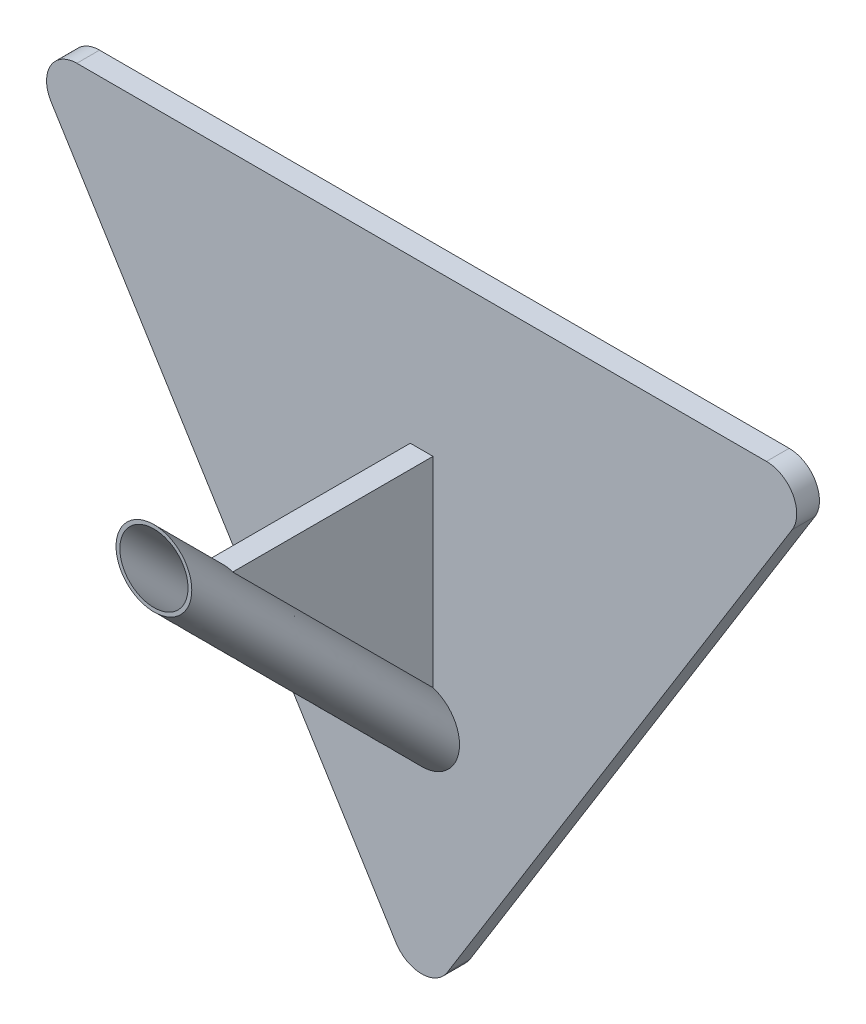
ISO-10303-21;
HEADER;
FILE_DESCRIPTION(('STEP AP214'),'2;1');
FILE_NAME('part.step','',(''),(''),'','','');
FILE_SCHEMA(('AUTOMOTIVE_DESIGN { 1 0 10303 214 1 1 1 1 }'));
ENDSEC;
DATA;
#1=APPLICATION_CONTEXT('core data for automotive mechanical design processes');
#2=APPLICATION_PROTOCOL_DEFINITION('international standard','automotive_design',2000,#1);
#3=PRODUCT_CONTEXT('',#1,'mechanical');
#4=PRODUCT('Part','Part','',(#3));
#5=PRODUCT_RELATED_PRODUCT_CATEGORY('part','',(#4));
#6=PRODUCT_DEFINITION_FORMATION('','',#4);
#7=PRODUCT_DEFINITION_CONTEXT('part definition',#1,'design');
#8=PRODUCT_DEFINITION('design','',#6,#7);
#9=PRODUCT_DEFINITION_SHAPE('','',#8);
#10=(LENGTH_UNIT() NAMED_UNIT(*) SI_UNIT(.MILLI.,.METRE.));
#11=(NAMED_UNIT(*) PLANE_ANGLE_UNIT() SI_UNIT($,.RADIAN.));
#12=(NAMED_UNIT(*) SI_UNIT($,.STERADIAN.) SOLID_ANGLE_UNIT());
#13=UNCERTAINTY_MEASURE_WITH_UNIT(LENGTH_MEASURE(1.E-05),#10,'distance_accuracy_value','');
#14=(GEOMETRIC_REPRESENTATION_CONTEXT(3) GLOBAL_UNCERTAINTY_ASSIGNED_CONTEXT((#13)) GLOBAL_UNIT_ASSIGNED_CONTEXT((#10,
#11,#12)) REPRESENTATION_CONTEXT('',''));
#15=CARTESIAN_POINT('',(0.,0.,0.));
#16=DIRECTION('',(0.,0.,1.));
#17=DIRECTION('',(1.,0.,0.));
#18=AXIS2_PLACEMENT_3D('',#15,#16,#17);
#19=CARTESIAN_POINT('',(0.,67.6582467498103,38.3553390593276));
#20=DIRECTION('',(0.,0.,1.));
#21=DIRECTION('',(1.,0.,0.));
#22=AXIS2_PLACEMENT_3D('',#19,#20,#21);
#23=PLANE('',#22);
#24=CARTESIAN_POINT('',(4.5,67.6582467498103,38.3553390593276));
#25=CARTESIAN_POINT('',(4.49999863216557,67.5336029292304,38.3553390593276));
#26=CARTESIAN_POINT('',(4.4948162883363,67.4089248746921,38.3553390593276));
#27=CARTESIAN_POINT('',(4.47411340059179,67.1603737042484,38.3553390593276));
#28=CARTESIAN_POINT('',(4.45858667620921,67.0365011142886,38.3553390593276));
#29=CARTESIAN_POINT('',(4.41702068960149,66.7888194952652,38.3553390593276));
#30=CARTESIAN_POINT('',(4.39084340449735,66.6650335413329,38.3553390593276));
#31=CARTESIAN_POINT('',(4.32815023709047,66.4200590795963,38.3553390593276));
#32=CARTESIAN_POINT('',(4.29163038547983,66.2988715882854,38.3553390593276));
#33=CARTESIAN_POINT('',(4.20847933344488,66.0598973113912,38.3553390593276));
#34=CARTESIAN_POINT('',(4.16183932745359,65.9421135892106,38.3553390593276));
#35=CARTESIAN_POINT('',(4.05877939423001,65.7108532167434,38.3553390593276));
#36=CARTESIAN_POINT('',(4.00235584821095,65.5973781791742,38.3553390593276));
#37=CARTESIAN_POINT('',(3.88019485255479,65.3756841351288,38.3553390593276));
#38=CARTESIAN_POINT('',(3.81446540923091,65.267460716796,38.3553390593276));
#39=CARTESIAN_POINT('',(3.67409761484886,65.0568965830804,38.3553390593276));
#40=CARTESIAN_POINT('',(3.5994559855126,64.9545580530436,38.3553390593276));
#41=CARTESIAN_POINT('',(3.44186532367716,64.7565992184749,38.3553390593276));
#42=CARTESIAN_POINT('',(3.35892170118079,64.6609746070603,38.3553390593276));
#43=CARTESIAN_POINT('',(3.18524396530824,64.477016183009,38.3553390593276));
#44=CARTESIAN_POINT('',(3.09450698804379,64.3886850741647,38.3553390593276));
#45=CARTESIAN_POINT('',(2.90593817714877,64.2200026873215,38.3553390593276));
#46=CARTESIAN_POINT('',(2.80810816052682,64.1396493780761,38.3553390593276));
#47=CARTESIAN_POINT('',(2.60599064726998,63.9874398276016,38.3553390593276));
#48=CARTESIAN_POINT('',(2.50170077949024,63.9155867349499,38.3553390593276));
#49=CARTESIAN_POINT('',(2.28747193397104,63.780944512017,38.3553390593276));
#50=CARTESIAN_POINT('',(2.17753476304086,63.7181525069046,38.3553390593276));
#51=CARTESIAN_POINT('',(1.95272079616753,63.6020300296473,38.3553390593276));
#52=CARTESIAN_POINT('',(1.83784219137844,63.5487030594978,38.3553390593276));
#53=CARTESIAN_POINT('',(1.60404539205042,63.451937515367,38.3553390593276));
#54=CARTESIAN_POINT('',(1.48512879748648,63.4084950761827,38.3553390593276));
#55=CARTESIAN_POINT('',(1.24401706488849,63.3317659833633,38.3553390593276));
#56=CARTESIAN_POINT('',(1.12182073265543,63.2984830850704,38.3553390593276));
#57=CARTESIAN_POINT('',(0.875095234224416,63.2423436802761,38.3553390593276));
#58=CARTESIAN_POINT('',(0.750566959808413,63.2194832694791,38.3553390593276));
#59=CARTESIAN_POINT('',(0.500016027592844,63.1843202763519,38.3553390593276));
#60=CARTESIAN_POINT('',(0.373992835043333,63.1720215950722,38.3553390593276));
#61=CARTESIAN_POINT('',(-0.00488378898220212,63.1511644230771,38.3553390593276));
#62=CARTESIAN_POINT('',(-0.258811691675657,63.1585842092215,38.3553390593276));
#63=CARTESIAN_POINT('',(-0.761678733334081,63.2159520498029,38.3553390593276));
#64=CARTESIAN_POINT('',(-1.01061787584192,63.2659000740363,38.3553390593276));
#65=CARTESIAN_POINT('',(-1.49661445848121,63.4068797548449,38.3553390593276));
#66=CARTESIAN_POINT('',(-1.73367189902085,63.4979114100086,38.3553390593276));
#67=CARTESIAN_POINT('',(-2.18912940914464,63.7184814790502,38.3553390593276));
#68=CARTESIAN_POINT('',(-2.40752946419588,63.8480199229221,38.3553390593276));
#69=CARTESIAN_POINT('',(-2.8194846708646,64.1419243731594,38.3553390593276));
#70=CARTESIAN_POINT('',(-3.01303982788752,64.3062903719474,38.3553390593276));
#71=CARTESIAN_POINT('',(-3.36980742691301,64.6651845356763,38.3553390593276));
#72=CARTESIAN_POINT('',(-3.53301987934596,64.8597126902488,38.3553390593276));
#73=CARTESIAN_POINT('',(-3.82446995599163,65.2734089991595,38.3553390593276));
#74=CARTESIAN_POINT('',(-3.95270757632396,65.4925771562315,38.3553390593276));
#75=CARTESIAN_POINT('',(-4.17056740074962,65.9493320228029,38.3553390593276));
#76=CARTESIAN_POINT('',(-4.26018960013751,66.1869187345467,38.3553390593276));
#77=CARTESIAN_POINT('',(-4.39827469098261,66.6737661162989,38.3553390593276));
#78=CARTESIAN_POINT('',(-4.44673758385932,66.9230267859047,38.3553390593276));
#79=CARTESIAN_POINT('',(-4.50112765877788,67.4261469110167,38.3553390593276));
#80=CARTESIAN_POINT('',(-4.50705484307137,67.6800063662794,38.3553390593276));
#81=CARTESIAN_POINT('',(-4.47620775687239,68.1851154778984,38.3553390593276));
#82=CARTESIAN_POINT('',(-4.43943348686597,68.4363651342843,38.3553390593276));
#83=CARTESIAN_POINT('',(-4.32421806888734,68.9291309064951,38.3553390593276));
#84=CARTESIAN_POINT('',(-4.24577691776008,69.1706470215829,38.3553390593276));
#85=CARTESIAN_POINT('',(-4.04948926803106,69.6370581454786,38.3553390593276));
#86=CARTESIAN_POINT('',(-3.93164276662302,69.8619531531027,38.3553390593276));
#87=CARTESIAN_POINT('',(-3.65975979534584,70.2888559293309,38.3553390593276));
#88=CARTESIAN_POINT('',(-3.5057233333699,70.4908637029267,38.3553390593276));
#89=CARTESIAN_POINT('',(-3.25107825516476,70.7721794790838,38.3553390593276));
#90=CARTESIAN_POINT('',(-3.16221082891384,70.8623779698412,38.3553390593276));
#91=CARTESIAN_POINT('',(-2.97720605180269,71.0349635287638,38.3553390593276));
#92=CARTESIAN_POINT('',(-2.88107139611574,71.1173534675595,38.3553390593276));
#93=CARTESIAN_POINT('',(-2.68217282664714,71.2737646677107,38.3553390593276));
#94=CARTESIAN_POINT('',(-2.57940647453808,71.3477828230952,38.3553390593276));
#95=CARTESIAN_POINT('',(-2.36804023057164,71.486873424465,38.3553390593276));
#96=CARTESIAN_POINT('',(-2.25944250566161,71.551949161908,38.3553390593276));
#97=CARTESIAN_POINT('',(-2.03711107036689,71.6727443460039,38.3553390593276));
#98=CARTESIAN_POINT('',(-1.92337547710172,71.7284603266957,38.3553390593276));
#99=CARTESIAN_POINT('',(-1.69165696788368,71.8300924073725,38.3553390593276));
#100=CARTESIAN_POINT('',(-1.57367563496175,71.8760121165638,38.3553390593276));
#101=CARTESIAN_POINT('',(-1.33422042522474,71.9577661914834,38.3553390593276));
#102=CARTESIAN_POINT('',(-1.21274527905356,71.9935968393566,38.3553390593276));
#103=CARTESIAN_POINT('',(-0.967253326478502,72.0548841821335,38.3553390593276));
#104=CARTESIAN_POINT('',(-0.843237474657413,72.0803447008154,38.3553390593276));
#105=CARTESIAN_POINT('',(-0.59345573610406,72.1207372878869,38.3553390593276));
#106=CARTESIAN_POINT('',(-0.467689219192182,72.1356654595255,38.3553390593276));
#107=CARTESIAN_POINT('',(-0.215392245016477,72.1548683629049,38.3553390593276));
#108=CARTESIAN_POINT('',(-0.0888620868257462,72.1591470244108,38.3553390593276));
#109=CARTESIAN_POINT('',(0.164155778223506,72.1570315175985,38.3553390593276));
#110=CARTESIAN_POINT('',(0.29064345216074,72.1506334082019,38.3553390593276));
#111=CARTESIAN_POINT('',(0.542583336543832,72.1272067045538,38.3553390593276));
#112=CARTESIAN_POINT('',(0.668035911913146,72.1101820345011,38.3553390593276));
#113=CARTESIAN_POINT('',(0.917106375475894,72.065618657603,38.3553390593276));
#114=CARTESIAN_POINT('',(1.04072358502591,72.0380761575604,38.3553390593276));
#115=CARTESIAN_POINT('',(1.28515258601976,71.9726855711372,38.3553390593276));
#116=CARTESIAN_POINT('',(1.40596539582722,71.9348412912536,38.3553390593276));
#117=CARTESIAN_POINT('',(1.64402017168368,71.8490950361906,38.3553390593276));
#118=CARTESIAN_POINT('',(1.76126074489898,71.8011891939936,38.3553390593276));
#119=CARTESIAN_POINT('',(1.99124601352619,71.6956889561207,38.3553390593276));
#120=CARTESIAN_POINT('',(2.10399234798738,71.638098133298,38.3553390593276));
#121=CARTESIAN_POINT('',(2.32427250645094,71.5136024714567,38.3553390593276));
#122=CARTESIAN_POINT('',(2.4318044947692,71.4466943839792,38.3553390593276));
#123=CARTESIAN_POINT('',(2.64082320395642,71.3040743479585,38.3553390593276));
#124=CARTESIAN_POINT('',(2.74231132033787,71.2283644437413,38.3553390593276));
#125=CARTESIAN_POINT('',(2.93850624509945,71.0686957818468,38.3553390593276));
#126=CARTESIAN_POINT('',(3.03321629975703,70.9847410192813,38.3553390593276));
#127=CARTESIAN_POINT('',(3.2153030444252,70.8090980833249,38.3553390593276));
#128=CARTESIAN_POINT('',(3.30267256091832,70.7174025166859,38.3553390593276));
#129=CARTESIAN_POINT('',(3.55259925799246,70.4318510100288,38.3553390593276));
#130=CARTESIAN_POINT('',(3.70323106600921,70.2273211199096,38.3553390593276));
#131=CARTESIAN_POINT('',(3.96795669605343,69.7958568092576,38.3553390593276));
#132=CARTESIAN_POINT('',(4.08205217038445,69.5689234024994,38.3553390593276));
#133=CARTESIAN_POINT('',(4.22345670169909,69.2166219551898,38.3553390593276));
#134=CARTESIAN_POINT('',(4.26566987757037,69.0970444371154,38.3553390593276));
#135=CARTESIAN_POINT('',(4.33984148026907,68.8548189254477,38.3553390593276));
#136=CARTESIAN_POINT('',(4.37180791378932,68.732173410341,38.3553390593276));
#137=CARTESIAN_POINT('',(4.42523114566654,68.4848736470993,38.3553390593276));
#138=CARTESIAN_POINT('',(4.44670793363915,68.3602236908979,38.3553390593276));
#139=CARTESIAN_POINT('',(4.47908935145022,68.1095879938359,38.3553390593276));
#140=CARTESIAN_POINT('',(4.48999824923307,67.9836028130177,38.3553390593276));
#141=CARTESIAN_POINT('',(4.49853047782964,67.791067686741,38.3553390593276));
#142=CARTESIAN_POINT('',(4.50000072883816,67.724662078119,38.3553390593276));
#143=CARTESIAN_POINT('',(4.5,67.6582467498103,38.3553390593276));
#144=B_SPLINE_CURVE_WITH_KNOTS('',3,(#24,#25,#26,#27,#28,#29,#30,#31,#32,#33,#34,#35,#36,#37,
#38,#39,#40,#41,#42,#43,#44,#45,#46,#47,#48,#49,#50,#51,#52,#53,#54,#55,#56,#57,#58,#59,#60,#61,
#62,#63,#64,#65,#66,#67,#68,#69,#70,#71,#72,#73,#74,#75,#76,#77,#78,#79,#80,#81,#82,#83,#84,#85,
#86,#87,#88,#89,#90,#91,#92,#93,#94,#95,#96,#97,#98,#99,#100,#101,#102,#103,#104,#105,#106,#107,
#108,#109,#110,#111,#112,#113,#114,#115,#116,#117,#118,#119,#120,#121,#122,#123,#124,#125,#126,
#127,#128,#129,#130,#131,#132,#133,#134,#135,#136,#137,#138,#139,#140,#141,#142,#143),
.UNSPECIFIED.,.T.,.F.,(4,2,2,2,2,2,2,2,2,2,2,2,2,2,2,2,2,2,2,2,2,2,2,2,2,2,2,2,2,2,2,2,2,2,2,2,
2,2,2,2,2,2,2,2,2,2,2,2,2,2,2,2,2,2,2,2,2,2,2,4),(0.,0.373883072721889,0.747989730304699,
1.12710729953578,1.50637056552371,1.88596516208257,2.26570046575624,2.64511102800906,
3.02466158594704,3.4039664000145,3.78341120164495,4.16275914282797,4.54224716174658,
4.9216145136934,5.30112193757467,5.68048070453953,6.05997952720741,6.43933607141451,
6.81883267348468,7.57701363489777,8.33519405785459,9.09337445476492,9.85155544224414,
10.6097362647673,11.3679168266634,12.1260974726784,12.8842782110806,13.6424589233347,
14.4006395954541,15.1588202589434,15.9170009798426,16.6751817547364,17.4333623642673,
17.8128599647592,18.1922175062795,18.5717153327377,18.9510731001964,19.3305710374015,
19.7099289151149,20.0894264051566,20.46878383611,20.8482815479795,21.2276392010027,
21.6071369159466,21.9864945720176,22.3659891707337,22.7453437364775,23.1248443694022,
23.5042053079306,23.8836988431228,24.2631044118825,24.6423270353399,25.021916043752,
25.7801138825644,26.5382774281175,26.9183299347248,27.2980847444069,27.6771130221956,
28.0559881618635,28.2552083631404),.UNSPECIFIED.);
#145=CARTESIAN_POINT('',(4.5,67.6582467498103,38.3553390593276));
#146=VERTEX_POINT('',#145);
#147=EDGE_CURVE('E173',#146,#146,#144,.T.);
#148=ORIENTED_EDGE('',*,*,#147,.T.);
#149=EDGE_LOOP('',(#148));
#150=FACE_BOUND('',#149,.T.);
#151=CARTESIAN_POINT('',(0.,67.6582467498103,38.3553390593276));
#152=DIRECTION('',(0.,0.,1.));
#153=DIRECTION('',(1.,0.,0.));
#154=AXIS2_PLACEMENT_3D('',#151,#152,#153);
#155=CIRCLE('',#154,5.);
#156=CARTESIAN_POINT('',(5.,67.6582467498103,38.3553390593276));
#157=VERTEX_POINT('',#156);
#158=EDGE_CURVE('E179',#157,#157,#155,.T.);
#159=ORIENTED_EDGE('',*,*,#158,.T.);
#160=EDGE_LOOP('',(#159));
#161=FACE_BOUND('',#160,.T.);
#162=ADVANCED_FACE('F37',(#150,#161),#23,.T.);
#163=CARTESIAN_POINT('',(52.7264413931926,84.9701263857494,3.));
#164=DIRECTION('',(-0.849701263857494,0.527264413931926,0.));
#165=DIRECTION('',(-0.527264413931926,-0.849701263857494,0.));
#166=AXIS2_PLACEMENT_3D('',#163,#164,#165);
#167=PLANE('',#166);
#168=DIRECTION('',(0.527264413931926,0.849701263857494,0.));
#169=VECTOR('',#168,1.);
#170=CARTESIAN_POINT('',(52.7264413931926,84.9701263857494,3.));
#171=LINE('',#170,#169);
#172=CARTESIAN_POINT('',(3.39880505542998,5.47726885201273,3.));
#173=VERTEX_POINT('',#172);
#174=CARTESIAN_POINT('',(48.935592960297,78.8610687300217,3.));
#175=VERTEX_POINT('',#174);
#176=EDGE_CURVE('E187',#173,#175,#171,.T.);
#177=ORIENTED_EDGE('',*,*,#176,.F.);
#178=DIRECTION('',(0.,0.,-1.));
#179=VECTOR('',#178,1.);
#180=CARTESIAN_POINT('',(3.39880505542997,5.47726885201273,3.));
#181=LINE('',#180,#179);
#182=CARTESIAN_POINT('',(3.39880505542998,5.47726885201273,0.));
#183=VERTEX_POINT('',#182);
#184=EDGE_CURVE('E201',#173,#183,#181,.T.);
#185=ORIENTED_EDGE('',*,*,#184,.T.);
#186=DIRECTION('',(0.527264413931926,0.849701263857494,0.));
#187=VECTOR('',#186,1.);
#188=CARTESIAN_POINT('',(52.7264413931926,84.9701263857494,0.));
#189=LINE('',#188,#187);
#190=CARTESIAN_POINT('',(48.935592960297,78.8610687300217,0.));
#191=VERTEX_POINT('',#190);
#192=EDGE_CURVE('E186',#183,#191,#189,.T.);
#193=ORIENTED_EDGE('',*,*,#192,.T.);
#194=DIRECTION('',(0.,0.,-1.));
#195=VECTOR('',#194,1.);
#196=CARTESIAN_POINT('',(48.935592960297,78.8610687300217,3.));
#197=LINE('',#196,#195);
#198=EDGE_CURVE('E182',#191,#175,#197,.F.);
#199=ORIENTED_EDGE('',*,*,#198,.T.);
#200=EDGE_LOOP('',(#177,#185,#193,#199));
#201=FACE_BOUND('',#200,.T.);
#202=ADVANCED_FACE('F244',(#201),#167,.F.);
#203=CARTESIAN_POINT('',(-52.7264413931926,84.9701263857494,3.));
#204=DIRECTION('',(0.,-1.,0.));
#205=DIRECTION('',(1.,0.,0.));
#206=AXIS2_PLACEMENT_3D('',#203,#204,#205);
#207=PLANE('',#206);
#208=DIRECTION('',(-1.,0.,0.));
#209=VECTOR('',#208,1.);
#210=CARTESIAN_POINT('',(-52.7264413931926,84.9701263857494,0.));
#211=LINE('',#210,#209);
#212=CARTESIAN_POINT('',(45.536787904867,84.9701263857494,0.));
#213=VERTEX_POINT('',#212);
#214=CARTESIAN_POINT('',(-45.536787904867,84.9701263857494,0.));
#215=VERTEX_POINT('',#214);
#216=EDGE_CURVE('E196',#213,#215,#211,.T.);
#217=ORIENTED_EDGE('',*,*,#216,.T.);
#218=DIRECTION('',(0.,0.,-1.));
#219=VECTOR('',#218,1.);
#220=CARTESIAN_POINT('',(-45.536787904867,84.9701263857494,3.));
#221=LINE('',#220,#219);
#222=CARTESIAN_POINT('',(-45.536787904867,84.9701263857494,3.));
#223=VERTEX_POINT('',#222);
#224=EDGE_CURVE('E11',#215,#223,#221,.F.);
#225=ORIENTED_EDGE('',*,*,#224,.T.);
#226=DIRECTION('',(-1.,0.,0.));
#227=VECTOR('',#226,1.);
#228=CARTESIAN_POINT('',(-52.7264413931926,84.9701263857494,3.));
#229=LINE('',#228,#227);
#230=CARTESIAN_POINT('',(45.536787904867,84.9701263857494,3.));
#231=VERTEX_POINT('',#230);
#232=EDGE_CURVE('E189',#231,#223,#229,.T.);
#233=ORIENTED_EDGE('',*,*,#232,.F.);
#234=DIRECTION('',(0.,0.,-1.));
#235=VECTOR('',#234,1.);
#236=CARTESIAN_POINT('',(45.536787904867,84.9701263857494,3.));
#237=LINE('',#236,#235);
#238=EDGE_CURVE('E45',#231,#213,#237,.T.);
#239=ORIENTED_EDGE('',*,*,#238,.T.);
#240=EDGE_LOOP('',(#217,#225,#233,#239));
#241=FACE_BOUND('',#240,.T.);
#242=ADVANCED_FACE('F222',(#241),#207,.F.);
#243=CARTESIAN_POINT('',(0.,0.,3.));
#244=DIRECTION('',(0.849701263857494,0.527264413931926,0.));
#245=DIRECTION('',(-0.527264413931926,0.849701263857494,0.));
#246=AXIS2_PLACEMENT_3D('',#243,#244,#245);
#247=PLANE('',#246);
#248=DIRECTION('',(0.527264413931926,-0.849701263857494,0.));
#249=VECTOR('',#248,1.);
#250=CARTESIAN_POINT('',(0.,0.,0.));
#251=LINE('',#250,#249);
#252=CARTESIAN_POINT('',(-48.935592960297,78.8610687300217,0.));
#253=VERTEX_POINT('',#252);
#254=CARTESIAN_POINT('',(-3.39880505542998,5.47726885201274,0.));
#255=VERTEX_POINT('',#254);
#256=EDGE_CURVE('E190',#253,#255,#251,.T.);
#257=ORIENTED_EDGE('',*,*,#256,.T.);
#258=DIRECTION('',(0.,0.,-1.));
#259=VECTOR('',#258,1.);
#260=CARTESIAN_POINT('',(-3.39880505542997,5.47726885201274,3.));
#261=LINE('',#260,#259);
#262=CARTESIAN_POINT('',(-3.39880505542998,5.47726885201274,3.));
#263=VERTEX_POINT('',#262);
#264=EDGE_CURVE('E213',#255,#263,#261,.F.);
#265=ORIENTED_EDGE('',*,*,#264,.T.);
#266=DIRECTION('',(0.527264413931926,-0.849701263857494,0.));
#267=VECTOR('',#266,1.);
#268=CARTESIAN_POINT('',(0.,0.,3.));
#269=LINE('',#268,#267);
#270=CARTESIAN_POINT('',(-48.935592960297,78.8610687300217,3.));
#271=VERTEX_POINT('',#270);
#272=EDGE_CURVE('E183',#271,#263,#269,.T.);
#273=ORIENTED_EDGE('',*,*,#272,.F.);
#274=DIRECTION('',(0.,0.,-1.));
#275=VECTOR('',#274,1.);
#276=CARTESIAN_POINT('',(-48.935592960297,78.8610687300217,3.));
#277=LINE('',#276,#275);
#278=EDGE_CURVE('E210',#271,#253,#277,.T.);
#279=ORIENTED_EDGE('',*,*,#278,.T.);
#280=EDGE_LOOP('',(#257,#265,#273,#279));
#281=FACE_BOUND('',#280,.T.);
#282=ADVANCED_FACE('F234',(#281),#247,.F.);
#283=CARTESIAN_POINT('',(0.,0.,3.));
#284=DIRECTION('',(0.,0.,-1.));
#285=DIRECTION('',(-1.,0.,0.));
#286=AXIS2_PLACEMENT_3D('',#283,#284,#285);
#287=PLANE('',#286);
#288=ORIENTED_EDGE('',*,*,#272,.T.);
#289=CARTESIAN_POINT('',(0.,7.58632650774044,3.));
#290=DIRECTION('',(0.,0.,-1.));
#291=DIRECTION('',(-1.,0.,0.));
#292=AXIS2_PLACEMENT_3D('',#289,#290,#291);
#293=CIRCLE('',#292,4.);
#294=EDGE_CURVE('E218',#263,#173,#293,.F.);
#295=ORIENTED_EDGE('',*,*,#294,.T.);
#296=ORIENTED_EDGE('',*,*,#176,.T.);
#297=CARTESIAN_POINT('',(45.536787904867,80.9701263857494,3.));
#298=DIRECTION('',(0.,0.,-1.));
#299=DIRECTION('',(-1.,0.,0.));
#300=AXIS2_PLACEMENT_3D('',#297,#298,#299);
#301=CIRCLE('',#300,4.);
#302=EDGE_CURVE('E57',#175,#231,#301,.F.);
#303=ORIENTED_EDGE('',*,*,#302,.T.);
#304=ORIENTED_EDGE('',*,*,#232,.T.);
#305=CARTESIAN_POINT('',(-45.536787904867,80.9701263857494,3.));
#306=DIRECTION('',(0.,0.,-1.));
#307=DIRECTION('',(-1.,0.,0.));
#308=AXIS2_PLACEMENT_3D('',#305,#306,#307);
#309=CIRCLE('',#308,4.);
#310=EDGE_CURVE('E216',#223,#271,#309,.F.);
#311=ORIENTED_EDGE('',*,*,#310,.T.);
#312=EDGE_LOOP('',(#288,#295,#296,#303,#304,#311));
#313=FACE_BOUND('',#312,.T.);
#314=DIRECTION('',(0.,-1.,0.));
#315=VECTOR('',#314,1.);
#316=CARTESIAN_POINT('',(1.5,0.,3.));
#317=LINE('',#316,#315);
#318=CARTESIAN_POINT('',(1.5,63.5290016845209,3.));
#319=VERTEX_POINT('',#318);
#320=CARTESIAN_POINT('',(1.5,37.0726036975678,3.));
#321=VERTEX_POINT('',#320);
#322=EDGE_CURVE('E131',#319,#321,#317,.T.);
#323=ORIENTED_EDGE('',*,*,#322,.T.);
#324=CARTESIAN_POINT('',(0.,32.3029076904831,3.));
#325=DIRECTION('',(0.,0.,1.));
#326=DIRECTION('',(1.,0.,0.));
#327=AXIS2_PLACEMENT_3D('',#324,#325,#326);
#328=CIRCLE('',#327,5.);
#329=CARTESIAN_POINT('',(-1.5,37.0726036975678,3.));
#330=VERTEX_POINT('',#329);
#331=EDGE_CURVE('E180',#330,#321,#328,.T.);
#332=ORIENTED_EDGE('',*,*,#331,.F.);
#333=DIRECTION('',(0.,-1.,0.));
#334=VECTOR('',#333,1.);
#335=CARTESIAN_POINT('',(-1.5,0.,3.));
#336=LINE('',#335,#334);
#337=CARTESIAN_POINT('',(-1.5,63.5290016845209,3.));
#338=VERTEX_POINT('',#337);
#339=EDGE_CURVE('E113',#338,#330,#336,.T.);
#340=ORIENTED_EDGE('',*,*,#339,.F.);
#341=DIRECTION('',(-1.,0.,0.));
#342=VECTOR('',#341,1.);
#343=CARTESIAN_POINT('',(0.,63.5290016845209,3.));
#344=LINE('',#343,#342);
#345=EDGE_CURVE('E125',#338,#319,#344,.F.);
#346=ORIENTED_EDGE('',*,*,#345,.T.);
#347=EDGE_LOOP('',(#323,#332,#340,#346));
#348=FACE_BOUND('',#347,.T.);
#349=ADVANCED_FACE('F237',(#313,#348),#287,.F.);
#350=CARTESIAN_POINT('',(0.,0.,0.));
#351=DIRECTION('',(0.,0.,-1.));
#352=DIRECTION('',(-1.,0.,0.));
#353=AXIS2_PLACEMENT_3D('',#350,#351,#352);
#354=PLANE('',#353);
#355=ORIENTED_EDGE('',*,*,#192,.F.);
#356=CARTESIAN_POINT('',(0.,7.58632650774044,0.));
#357=DIRECTION('',(0.,0.,-1.));
#358=DIRECTION('',(-1.,0.,0.));
#359=AXIS2_PLACEMENT_3D('',#356,#357,#358);
#360=CIRCLE('',#359,4.);
#361=EDGE_CURVE('E208',#183,#255,#360,.T.);
#362=ORIENTED_EDGE('',*,*,#361,.T.);
#363=ORIENTED_EDGE('',*,*,#256,.F.);
#364=CARTESIAN_POINT('',(-45.536787904867,80.9701263857494,0.));
#365=DIRECTION('',(0.,0.,-1.));
#366=DIRECTION('',(-1.,0.,0.));
#367=AXIS2_PLACEMENT_3D('',#364,#365,#366);
#368=CIRCLE('',#367,4.);
#369=EDGE_CURVE('E206',#253,#215,#368,.T.);
#370=ORIENTED_EDGE('',*,*,#369,.T.);
#371=ORIENTED_EDGE('',*,*,#216,.F.);
#372=CARTESIAN_POINT('',(45.536787904867,80.9701263857494,0.));
#373=DIRECTION('',(0.,0.,-1.));
#374=DIRECTION('',(-1.,0.,0.));
#375=AXIS2_PLACEMENT_3D('',#372,#373,#374);
#376=CIRCLE('',#375,4.);
#377=EDGE_CURVE('E204',#213,#191,#376,.T.);
#378=ORIENTED_EDGE('',*,*,#377,.T.);
#379=EDGE_LOOP('',(#355,#362,#363,#370,#371,#378));
#380=FACE_BOUND('',#379,.T.);
#381=ADVANCED_FACE('F226',(#380),#354,.T.);
#382=CARTESIAN_POINT('',(5.,32.3029076904831,3.));
#383=CARTESIAN_POINT('',(5.,67.6582467498103,38.3553390593276));
#384=CARTESIAN_POINT('',(5.,42.3029076904831,3.));
#385=CARTESIAN_POINT('',(5.,77.6582467498103,38.3553390593276));
#386=CARTESIAN_POINT('',(-5.,42.3029076904831,3.));
#387=CARTESIAN_POINT('',(-5.,77.6582467498103,38.3553390593276));
#388=CARTESIAN_POINT('',(-5.,32.3029076904831,3.));
#389=CARTESIAN_POINT('',(-5.,67.6582467498103,38.3553390593276));
#390=CARTESIAN_POINT('',(-5.,22.3029076904831,3.));
#391=CARTESIAN_POINT('',(-5.,57.6582467498103,38.3553390593276));
#392=CARTESIAN_POINT('',(5.,22.3029076904831,3.));
#393=CARTESIAN_POINT('',(5.,57.6582467498103,38.3553390593276));
#394=CARTESIAN_POINT('',(5.,32.3029076904831,3.));
#395=CARTESIAN_POINT('',(5.,67.6582467498103,38.3553390593276));
#396=(BOUNDED_SURFACE() B_SPLINE_SURFACE(3,1,((#382,#383),(#384,#385),(#386,#387),(#388,#389),
(#390,#391),(#392,#393),(#394,#395)),.UNSPECIFIED.,.T.,.F.,.F.) B_SPLINE_SURFACE_WITH_KNOTS((4,
3,4),(2,2),(0.,0.5,1.),(0.,1.),
.UNSPECIFIED.) GEOMETRIC_REPRESENTATION_ITEM() RATIONAL_B_SPLINE_SURFACE(((1.,1.),
(0.333333333333333,0.333333333333333),(0.333333333333333,0.333333333333333),(1.,1.),
(0.333333333333333,0.333333333333333),(0.333333333333333,0.333333333333333),(1.,1.))) REPRESENTATION_ITEM('') SURFACE());
#397=DIRECTION('',(0.,0.707106781186544,0.707106781186551));
#398=VECTOR('',#397,1.);
#399=CARTESIAN_POINT('',(1.5,54.7502732272314,20.6776695296638));
#400=LINE('',#399,#398);
#401=CARTESIAN_POINT('',(1.5,63.5290016845209,29.4563979869534));
#402=VERTEX_POINT('',#401);
#403=EDGE_CURVE('E130',#402,#321,#400,.F.);
#404=CARTESIAN_POINT('',(-1.5,63.5290016845209,29.4563979869534));
#405=CARTESIAN_POINT('',(-1.36421078420366,63.5290016845209,29.4136787517272));
#406=CARTESIAN_POINT('',(-1.2265932360816,63.5290016845209,29.3767879016297));
#407=CARTESIAN_POINT('',(-0.948704979642877,63.5290016845209,29.3148633354327));
#408=CARTESIAN_POINT('',(-0.808434079554098,63.5290016845209,29.2898304798063));
#409=CARTESIAN_POINT('',(-0.529785482863992,63.5290016845209,29.2523029717718));
#410=CARTESIAN_POINT('',(-0.391447970206912,63.529001684521,29.2395108524058));
#411=CARTESIAN_POINT('',(-0.114246411109244,63.5290016845209,29.2254716613843));
#412=CARTESIAN_POINT('',(0.0246175284300971,63.5290016845209,29.2242223594781));
#413=CARTESIAN_POINT('',(0.387539850291418,63.5290016845209,29.2361006900602));
#414=CARTESIAN_POINT('',(0.611391008282608,63.5290016845209,29.2585575028271));
#415=CARTESIAN_POINT('',(0.94547718856288,63.529001684521,29.3149603494598));
#416=CARTESIAN_POINT('',(1.05770191588536,63.5290016845209,29.3379052193015));
#417=CARTESIAN_POINT('',(1.28033023881246,63.5290016845209,29.3914433872665));
#418=CARTESIAN_POINT('',(1.39073355253011,63.5290016845209,29.4220378576431));
#419=CARTESIAN_POINT('',(1.5,63.5290016845209,29.4563979869534));
#420=B_SPLINE_CURVE_WITH_KNOTS('',3,(#404,#405,#406,#407,#408,#409,#410,#411,#412,#413,#414,
#415,#416,#417,#418,#419),.UNSPECIFIED.,.F.,.F.,(4,2,2,2,2,2,2,4),(0.,0.426913459412284,
0.853857892968882,1.27014167411542,1.68634502112497,2.35890174318751,2.70231613818267,
3.04578319157757),.UNSPECIFIED.);
#421=CARTESIAN_POINT('',(-1.5,63.5290016845209,29.4563979869534));
#422=VERTEX_POINT('',#421);
#423=EDGE_CURVE('E122',#422,#402,#420,.T.);
#424=DIRECTION('',(0.,0.707106781186544,0.707106781186551));
#425=VECTOR('',#424,1.);
#426=CARTESIAN_POINT('',(-1.5,54.7502732272314,20.6776695296638));
#427=LINE('',#426,#425);
#428=EDGE_CURVE('E108',#422,#330,#427,.F.);
#429=ORIENTED_EDGE('',*,*,#158,.F.);
#430=EDGE_LOOP('',(#429));
#431=FACE_BOUND('',#430,.T.);
#432=ORIENTED_EDGE('',*,*,#331,.T.);
#433=ORIENTED_EDGE('',*,*,#403,.F.);
#434=ORIENTED_EDGE('',*,*,#423,.F.);
#435=ORIENTED_EDGE('',*,*,#428,.T.);
#436=EDGE_LOOP('',(#432,#433,#434,#435));
#437=FACE_BOUND('',#436,.T.);
#438=ADVANCED_FACE('F128',(#431,#437),#396,.T.);
#439=CARTESIAN_POINT('',(0.,32.3029076904831,3.));
#440=DIRECTION('',(0.,0.,1.));
#441=DIRECTION('',(1.,0.,0.));
#442=AXIS2_PLACEMENT_3D('',#439,#440,#441);
#443=PLANE('',#442);
#444=CARTESIAN_POINT('',(0.,32.3029076904831,3.));
#445=DIRECTION('',(0.,0.,1.));
#446=DIRECTION('',(1.,0.,0.));
#447=AXIS2_PLACEMENT_3D('',#444,#445,#446);
#448=CIRCLE('',#447,4.5);
#449=CARTESIAN_POINT('',(4.5,32.3029076904831,3.));
#450=VERTEX_POINT('',#449);
#451=EDGE_CURVE('E133',#450,#450,#448,.T.);
#452=ORIENTED_EDGE('',*,*,#451,.T.);
#453=EDGE_LOOP('',(#452));
#454=FACE_BOUND('',#453,.T.);
#455=ADVANCED_FACE('F157',(#454),#443,.T.);
#456=CARTESIAN_POINT('',(4.5,32.3029076904831,3.));
#457=CARTESIAN_POINT('',(4.5,68.8818705158493,39.5789628253666));
#458=CARTESIAN_POINT('',(4.5,41.3029076904831,3.));
#459=CARTESIAN_POINT('',(4.5,77.8818705158493,39.5789628253666));
#460=CARTESIAN_POINT('',(-4.5,41.3029076904831,3.));
#461=CARTESIAN_POINT('',(-4.5,77.8818705158493,39.5789628253666));
#462=CARTESIAN_POINT('',(-4.5,32.3029076904831,3.));
#463=CARTESIAN_POINT('',(-4.5,68.8818705158493,39.5789628253666));
#464=CARTESIAN_POINT('',(-4.5,23.3029076904831,3.));
#465=CARTESIAN_POINT('',(-4.5,59.8818705158493,39.5789628253666));
#466=CARTESIAN_POINT('',(4.5,23.3029076904831,3.));
#467=CARTESIAN_POINT('',(4.5,59.8818705158493,39.5789628253666));
#468=CARTESIAN_POINT('',(4.5,32.3029076904831,3.));
#469=CARTESIAN_POINT('',(4.5,68.8818705158493,39.5789628253666));
#470=(BOUNDED_SURFACE() B_SPLINE_SURFACE(3,1,((#456,#457),(#458,#459),(#460,#461),(#462,#463),
(#464,#465),(#466,#467),(#468,#469)),.UNSPECIFIED.,.T.,.F.,.F.) B_SPLINE_SURFACE_WITH_KNOTS((4,
3,4),(2,2),(0.,0.5,1.),(0.,1.),
.UNSPECIFIED.) GEOMETRIC_REPRESENTATION_ITEM() RATIONAL_B_SPLINE_SURFACE(((1.,1.),
(0.333333333333333,0.333333333333333),(0.333333333333333,0.333333333333333),(1.,1.),
(0.333333333333333,0.333333333333333),(0.333333333333333,0.333333333333333),(1.,1.))) REPRESENTATION_ITEM('') SURFACE());
#471=CARTESIAN_POINT('',(4.5,32.3029076904831,3.));
#472=CARTESIAN_POINT('',(4.5,32.6711924723511,3.368284781868));
#473=CARTESIAN_POINT('',(4.5,33.0394772542191,3.73656956373599));
#474=CARTESIAN_POINT('',(4.5,33.7760468179551,4.47313912747198));
#475=CARTESIAN_POINT('',(4.5,34.1443315998231,4.84142390933998));
#476=CARTESIAN_POINT('',(4.5,34.8809011635591,5.57799347307597));
#477=CARTESIAN_POINT('',(4.5,35.2491859454271,5.94627825494397));
#478=CARTESIAN_POINT('',(4.5,35.985755509163,6.68284781867996));
#479=CARTESIAN_POINT('',(4.5,36.354040291031,7.05113260054795));
#480=CARTESIAN_POINT('',(4.5,37.090609854767,7.78770216428394));
#481=CARTESIAN_POINT('',(4.5,37.458894636635,8.15598694615194));
#482=CARTESIAN_POINT('',(4.5,38.195464200371,8.89255650988793));
#483=CARTESIAN_POINT('',(4.5,38.563748982239,9.26084129175593));
#484=CARTESIAN_POINT('',(4.5,39.300318545975,9.99741085549192));
#485=CARTESIAN_POINT('',(4.5,39.668603327843,10.3656956373599));
#486=CARTESIAN_POINT('',(4.5,40.4051728915789,11.1022652010959));
#487=CARTESIAN_POINT('',(4.5,40.7734576734469,11.4705499829639));
#488=CARTESIAN_POINT('',(4.5,41.5100272371829,12.2071195466999));
#489=CARTESIAN_POINT('',(4.5,41.8783120190509,12.5754043285679));
#490=CARTESIAN_POINT('',(4.5,42.6148815827869,13.3119738923039));
#491=CARTESIAN_POINT('',(4.5,42.9831663646549,13.6802586741719));
#492=CARTESIAN_POINT('',(4.5,43.7197359283909,14.4168282379079));
#493=CARTESIAN_POINT('',(4.5,44.0880207102589,14.7851130197759));
#494=CARTESIAN_POINT('',(4.5,44.8245902739948,15.5216825835119));
#495=CARTESIAN_POINT('',(4.5,45.1928750558628,15.8899673653799));
#496=CARTESIAN_POINT('',(4.5,45.9294446195988,16.6265369291158));
#497=CARTESIAN_POINT('',(4.5,46.2977294014668,16.9948217109838));
#498=CARTESIAN_POINT('',(4.5,47.0342989652028,17.7313912747198));
#499=CARTESIAN_POINT('',(4.5,47.4025837470708,18.0996760565878));
#500=CARTESIAN_POINT('',(4.5,48.1391533108068,18.8362456203238));
#501=CARTESIAN_POINT('',(4.5,48.5074380926748,19.2045304021918));
#502=CARTESIAN_POINT('',(4.5,49.2440076564107,19.9410999659278));
#503=CARTESIAN_POINT('',(4.5,49.6122924382787,20.3093847477958));
#504=CARTESIAN_POINT('',(4.5,50.3488620020147,21.0459543115318));
#505=CARTESIAN_POINT('',(4.5,50.7171467838827,21.4142390933998));
#506=CARTESIAN_POINT('',(4.5,51.4537163476187,22.1508086571358));
#507=CARTESIAN_POINT('',(4.5,51.8220011294867,22.5190934390038));
#508=CARTESIAN_POINT('',(4.5,52.5585706932227,23.2556630027398));
#509=CARTESIAN_POINT('',(4.5,52.9268554750907,23.6239477846078));
#510=CARTESIAN_POINT('',(4.5,53.6634250388266,24.3605173483438));
#511=CARTESIAN_POINT('',(4.5,54.0317098206946,24.7288021302118));
#512=CARTESIAN_POINT('',(4.5,54.7682793844306,25.4653716939477));
#513=CARTESIAN_POINT('',(4.5,55.1365641662986,25.8336564758157));
#514=CARTESIAN_POINT('',(4.5,55.8731337300346,26.5702260395517));
#515=CARTESIAN_POINT('',(4.5,56.2414185119026,26.9385108214197));
#516=CARTESIAN_POINT('',(4.5,56.9779880756386,27.6750803851557));
#517=CARTESIAN_POINT('',(4.5,57.3462728575066,28.0433651670237));
#518=CARTESIAN_POINT('',(4.5,58.0828424212425,28.7799347307597));
#519=CARTESIAN_POINT('',(4.5,58.4511272031105,29.1482195126277));
#520=CARTESIAN_POINT('',(4.5,59.1876967668465,29.8847890763637));
#521=CARTESIAN_POINT('',(4.5,59.5559815487145,30.2530738582317));
#522=CARTESIAN_POINT('',(4.5,60.2925511124505,30.9896434219677));
#523=CARTESIAN_POINT('',(4.5,60.6608358943185,31.3579282038357));
#524=CARTESIAN_POINT('',(4.5,61.3974054580545,32.0944977675717));
#525=CARTESIAN_POINT('',(4.5,61.7656902399224,32.4627825494397));
#526=CARTESIAN_POINT('',(4.5,62.5022598036584,33.1993521131757));
#527=CARTESIAN_POINT('',(4.5,62.8705445855264,33.5676368950437));
#528=CARTESIAN_POINT('',(4.5,63.6071141492624,34.3042064587796));
#529=CARTESIAN_POINT('',(4.5,63.9753989311304,34.6724912406476));
#530=CARTESIAN_POINT('',(4.5,64.7119684948664,35.4090608043836));
#531=CARTESIAN_POINT('',(4.5,65.0802532767344,35.7773455862516));
#532=CARTESIAN_POINT('',(4.5,65.8168228404704,36.5139151499876));
#533=CARTESIAN_POINT('',(4.5,66.1851076223384,36.8821999318556));
#534=CARTESIAN_POINT('',(4.5,66.9216771860743,37.6187694955916));
#535=CARTESIAN_POINT('',(4.5,67.2899619679423,37.9870542774596));
#536=CARTESIAN_POINT('',(4.5,67.6582467498103,38.3553390593276));
#537=B_SPLINE_CURVE_WITH_KNOTS('',3,(#471,#472,#473,#474,#475,#476,#477,#478,#479,#480,#481,
#482,#483,#484,#485,#486,#487,#488,#489,#490,#491,#492,#493,#494,#495,#496,#497,#498,#499,#500,
#501,#502,#503,#504,#505,#506,#507,#508,#509,#510,#511,#512,#513,#514,#515,#516,#517,#518,#519,
#520,#521,#522,#523,#524,#525,#526,#527,#528,#529,#530,#531,#532,#533,#534,#535,#536),
.UNSPECIFIED.,.F.,.F.,(4,2,2,2,2,2,2,2,2,2,2,2,2,2,2,2,2,2,2,2,2,2,2,2,2,2,2,2,2,2,2,2,4),(0.,
1.5625,3.125,4.6875,6.25,7.8125,9.37500000000001,10.9375,12.5,14.0625,15.625,17.1875,18.75,
20.3125,21.875,23.4375,25.,26.5625,28.125,29.6875,31.25,32.8125,34.375,35.9375,37.5,39.0625,
40.625,42.1875,43.75,45.3125,46.875,48.4375,50.),.UNSPECIFIED.);
#538=EDGE_CURVE('BSEAM155',#450,#146,#537,.T.);
#539=ORIENTED_EDGE('',*,*,#451,.F.);
#540=ORIENTED_EDGE('',*,*,#147,.F.);
#541=ORIENTED_EDGE('',*,*,#538,.T.);
#542=ORIENTED_EDGE('',*,*,#538,.F.);
#543=EDGE_LOOP('',(#539,#541,#540,#542));
#544=FACE_BOUND('',#543,.T.);
#545=ADVANCED_FACE('F155',(#544),#470,.F.);
#546=CARTESIAN_POINT('',(0.,63.5290016845209,29.2260939940381));
#547=DIRECTION('',(0.,-1.,0.));
#548=DIRECTION('',(0.,0.,-1.));
#549=AXIS2_PLACEMENT_3D('',#546,#547,#548);
#550=PLANE('',#549);
#551=ORIENTED_EDGE('',*,*,#345,.F.);
#552=DIRECTION('',(0.,0.,-1.));
#553=VECTOR('',#552,1.);
#554=CARTESIAN_POINT('',(-1.5,63.5290016845209,19.1776695296638));
#555=LINE('',#554,#553);
#556=EDGE_CURVE('E111',#422,#338,#555,.T.);
#557=ORIENTED_EDGE('',*,*,#556,.F.);
#558=ORIENTED_EDGE('',*,*,#423,.T.);
#559=DIRECTION('',(0.,0.,-1.));
#560=VECTOR('',#559,1.);
#561=CARTESIAN_POINT('',(1.5,63.5290016845209,19.1776695296638));
#562=LINE('',#561,#560);
#563=EDGE_CURVE('E117',#402,#319,#562,.T.);
#564=ORIENTED_EDGE('',*,*,#563,.T.);
#565=EDGE_LOOP('',(#551,#557,#558,#564));
#566=FACE_BOUND('',#565,.T.);
#567=ADVANCED_FACE('F120',(#566),#550,.F.);
#568=CARTESIAN_POINT('',(1.5,42.4850631928747,19.1776695296638));
#569=DIRECTION('',(1.,0.,0.));
#570=DIRECTION('',(0.,0.,-1.));
#571=AXIS2_PLACEMENT_3D('',#568,#569,#570);
#572=PLANE('',#571);
#573=ORIENTED_EDGE('',*,*,#322,.F.);
#574=ORIENTED_EDGE('',*,*,#563,.F.);
#575=ORIENTED_EDGE('',*,*,#403,.T.);
#576=EDGE_LOOP('',(#573,#574,#575));
#577=FACE_BOUND('',#576,.T.);
#578=ADVANCED_FACE('F154',(#577),#572,.T.);
#579=CARTESIAN_POINT('',(-1.5,42.4850631928747,19.1776695296638));
#580=DIRECTION('',(1.,0.,0.));
#581=DIRECTION('',(0.,0.,-1.));
#582=AXIS2_PLACEMENT_3D('',#579,#580,#581);
#583=PLANE('',#582);
#584=ORIENTED_EDGE('',*,*,#556,.T.);
#585=ORIENTED_EDGE('',*,*,#339,.T.);
#586=ORIENTED_EDGE('',*,*,#428,.F.);
#587=EDGE_LOOP('',(#584,#585,#586));
#588=FACE_BOUND('',#587,.T.);
#589=ADVANCED_FACE('F110',(#588),#583,.F.);
#590=CARTESIAN_POINT('',(0.,7.58632650774044,3.));
#591=DIRECTION('',(0.,0.,-1.));
#592=DIRECTION('',(-1.,0.,0.));
#593=AXIS2_PLACEMENT_3D('',#590,#591,#592);
#594=CYLINDRICAL_SURFACE('',#593,4.);
#595=ORIENTED_EDGE('',*,*,#294,.F.);
#596=ORIENTED_EDGE('',*,*,#264,.F.);
#597=ORIENTED_EDGE('',*,*,#361,.F.);
#598=ORIENTED_EDGE('',*,*,#184,.F.);
#599=EDGE_LOOP('',(#595,#596,#597,#598));
#600=FACE_BOUND('',#599,.T.);
#601=ADVANCED_FACE('F242',(#600),#594,.T.);
#602=CARTESIAN_POINT('',(-45.536787904867,80.9701263857494,3.));
#603=DIRECTION('',(0.,0.,-1.));
#604=DIRECTION('',(-1.,0.,0.));
#605=AXIS2_PLACEMENT_3D('',#602,#603,#604);
#606=CYLINDRICAL_SURFACE('',#605,4.);
#607=ORIENTED_EDGE('',*,*,#310,.F.);
#608=ORIENTED_EDGE('',*,*,#224,.F.);
#609=ORIENTED_EDGE('',*,*,#369,.F.);
#610=ORIENTED_EDGE('',*,*,#278,.F.);
#611=EDGE_LOOP('',(#607,#608,#609,#610));
#612=FACE_BOUND('',#611,.T.);
#613=ADVANCED_FACE('F231',(#612),#606,.T.);
#614=CARTESIAN_POINT('',(45.536787904867,80.9701263857494,3.));
#615=DIRECTION('',(0.,0.,-1.));
#616=DIRECTION('',(-1.,0.,0.));
#617=AXIS2_PLACEMENT_3D('',#614,#615,#616);
#618=CYLINDRICAL_SURFACE('',#617,4.);
#619=ORIENTED_EDGE('',*,*,#302,.F.);
#620=ORIENTED_EDGE('',*,*,#198,.F.);
#621=ORIENTED_EDGE('',*,*,#377,.F.);
#622=ORIENTED_EDGE('',*,*,#238,.F.);
#623=EDGE_LOOP('',(#619,#620,#621,#622));
#624=FACE_BOUND('',#623,.T.);
#625=ADVANCED_FACE('F39',(#624),#618,.T.);
#626=CLOSED_SHELL('',(#162,#202,#242,#282,#349,#381,#438,#455,#545,#567,#578,#589,#601,#613,#625));
#627=MANIFOLD_SOLID_BREP('B2',#626);
#628=ADVANCED_BREP_SHAPE_REPRESENTATION('',(#18,#627),#14);
#629=SHAPE_DEFINITION_REPRESENTATION(#9,#628);
ENDSEC;
END-ISO-10303-21;
